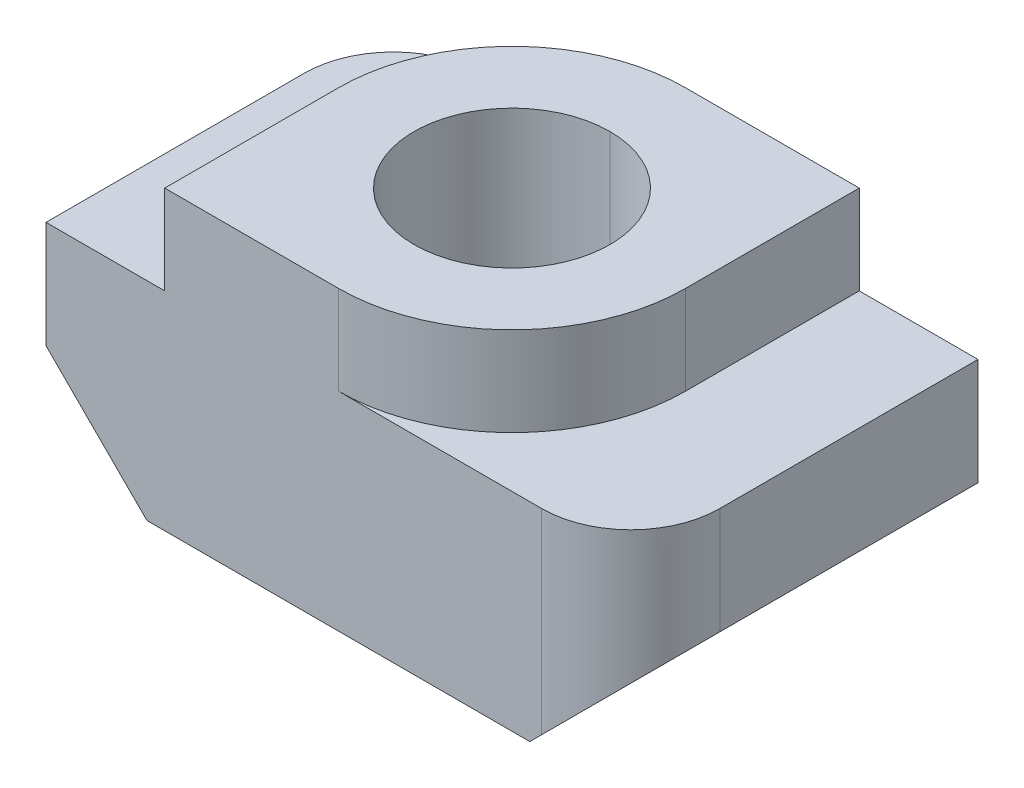
ISO-10303-21;
HEADER;
FILE_DESCRIPTION(('STEP AP214'),'2;1');
FILE_NAME('part.step','',(''),(''),'','','');
FILE_SCHEMA(('AUTOMOTIVE_DESIGN { 1 0 10303 214 1 1 1 1 }'));
ENDSEC;
DATA;
#1=APPLICATION_CONTEXT('core data for automotive mechanical design processes');
#2=APPLICATION_PROTOCOL_DEFINITION('international standard','automotive_design',2000,#1);
#3=PRODUCT_CONTEXT('',#1,'mechanical');
#4=PRODUCT('Part','Part','',(#3));
#5=PRODUCT_RELATED_PRODUCT_CATEGORY('part','',(#4));
#6=PRODUCT_DEFINITION_FORMATION('','',#4);
#7=PRODUCT_DEFINITION_CONTEXT('part definition',#1,'design');
#8=PRODUCT_DEFINITION('design','',#6,#7);
#9=PRODUCT_DEFINITION_SHAPE('','',#8);
#10=(LENGTH_UNIT() NAMED_UNIT(*) SI_UNIT(.MILLI.,.METRE.));
#11=(NAMED_UNIT(*) PLANE_ANGLE_UNIT() SI_UNIT($,.RADIAN.));
#12=(NAMED_UNIT(*) SI_UNIT($,.STERADIAN.) SOLID_ANGLE_UNIT());
#13=UNCERTAINTY_MEASURE_WITH_UNIT(LENGTH_MEASURE(1.E-05),#10,'distance_accuracy_value','');
#14=(GEOMETRIC_REPRESENTATION_CONTEXT(3) GLOBAL_UNCERTAINTY_ASSIGNED_CONTEXT((#13)) GLOBAL_UNIT_ASSIGNED_CONTEXT((#10,
#11,#12)) REPRESENTATION_CONTEXT('',''));
#15=CARTESIAN_POINT('',(0.,0.,0.));
#16=DIRECTION('',(0.,0.,1.));
#17=DIRECTION('',(1.,0.,0.));
#18=AXIS2_PLACEMENT_3D('',#15,#16,#17);
#19=CARTESIAN_POINT('',(3.425,3.5,1.425));
#20=DIRECTION('',(0.,-1.,0.));
#21=DIRECTION('',(0.,0.,-1.));
#22=AXIS2_PLACEMENT_3D('',#19,#20,#21);
#23=CYLINDRICAL_SURFACE('',#22,1.5);
#24=CARTESIAN_POINT('',(3.425,3.5,1.425));
#25=DIRECTION('',(0.,1.,0.));
#26=DIRECTION('',(0.,0.,-1.));
#27=AXIS2_PLACEMENT_3D('',#24,#25,#26);
#28=CIRCLE('',#27,1.5);
#29=CARTESIAN_POINT('',(3.425,3.5,2.925));
#30=VERTEX_POINT('',#29);
#31=CARTESIAN_POINT('',(4.925,3.5,1.425));
#32=VERTEX_POINT('',#31);
#33=EDGE_CURVE('E252',#30,#32,#28,.T.);
#34=ORIENTED_EDGE('',*,*,#33,.F.);
#35=DIRECTION('',(0.,1.,0.));
#36=VECTOR('',#35,1.);
#37=CARTESIAN_POINT('',(3.425,3.5,2.925));
#38=LINE('',#37,#36);
#39=CARTESIAN_POINT('',(3.425,0.200000000000006,2.925));
#40=VERTEX_POINT('',#39);
#41=EDGE_CURVE('E285',#40,#30,#38,.T.);
#42=ORIENTED_EDGE('',*,*,#41,.F.);
#43=CARTESIAN_POINT('',(4.925,1.7,1.425));
#44=CARTESIAN_POINT('',(4.925,1.7,2.30367965644035));
#45=CARTESIAN_POINT('',(4.30367965644036,1.07867965644036,2.925));
#46=CARTESIAN_POINT('',(3.425,0.200000000000006,2.925));
#47=(BOUNDED_CURVE() B_SPLINE_CURVE(3,(#43,#44,#45,#46),.UNSPECIFIED.,.F.,
.F.) B_SPLINE_CURVE_WITH_KNOTS((4,4),(3.1415926535898,4.71238898038469),
.UNSPECIFIED.) CURVE() GEOMETRIC_REPRESENTATION_ITEM() RATIONAL_B_SPLINE_CURVE((1.,
0.804737854124365,0.804737854124365,1.)) REPRESENTATION_ITEM(''));
#48=CARTESIAN_POINT('',(4.925,1.7,1.425));
#49=VERTEX_POINT('',#48);
#50=EDGE_CURVE('E11',#49,#40,#47,.T.);
#51=ORIENTED_EDGE('',*,*,#50,.F.);
#52=DIRECTION('',(0.,-1.,0.));
#53=VECTOR('',#52,1.);
#54=CARTESIAN_POINT('',(4.925,3.5,1.425));
#55=LINE('',#54,#53);
#56=EDGE_CURVE('E263',#32,#49,#55,.T.);
#57=ORIENTED_EDGE('',*,*,#56,.F.);
#58=EDGE_LOOP('',(#34,#42,#51,#57));
#59=FACE_BOUND('',#58,.T.);
#60=ADVANCED_FACE('F17',(#59),#23,.T.);
#61=CARTESIAN_POINT('',(-3.425,3.5,-1.425));
#62=DIRECTION('',(0.,-1.,0.));
#63=DIRECTION('',(0.,0.,-1.));
#64=AXIS2_PLACEMENT_3D('',#61,#62,#63);
#65=CYLINDRICAL_SURFACE('',#64,1.5);
#66=CARTESIAN_POINT('',(-3.425,3.5,-1.425));
#67=DIRECTION('',(0.,1.,0.));
#68=DIRECTION('',(0.,0.,-1.));
#69=AXIS2_PLACEMENT_3D('',#66,#67,#68);
#70=CIRCLE('',#69,1.5);
#71=CARTESIAN_POINT('',(-3.425,3.5,-2.925));
#72=VERTEX_POINT('',#71);
#73=CARTESIAN_POINT('',(-4.925,3.5,-1.425));
#74=VERTEX_POINT('',#73);
#75=EDGE_CURVE('E219',#72,#74,#70,.T.);
#76=ORIENTED_EDGE('',*,*,#75,.F.);
#77=DIRECTION('',(0.,1.,0.));
#78=VECTOR('',#77,1.);
#79=CARTESIAN_POINT('',(-3.425,3.5,-2.925));
#80=LINE('',#79,#78);
#81=CARTESIAN_POINT('',(-3.425,0.200000000000004,-2.925));
#82=VERTEX_POINT('',#81);
#83=EDGE_CURVE('E328',#82,#72,#80,.T.);
#84=ORIENTED_EDGE('',*,*,#83,.F.);
#85=CARTESIAN_POINT('',(-4.925,1.7,-1.425));
#86=CARTESIAN_POINT('',(-4.925,1.7,-2.30367965644035));
#87=CARTESIAN_POINT('',(-4.30367965644036,1.07867965644036,-2.925));
#88=CARTESIAN_POINT('',(-3.425,0.200000000000004,-2.925));
#89=(BOUNDED_CURVE() B_SPLINE_CURVE(3,(#85,#86,#87,#88),.UNSPECIFIED.,.F.,
.F.) B_SPLINE_CURVE_WITH_KNOTS((4,4),(3.1415926535898,4.71238898038469),
.UNSPECIFIED.) CURVE() GEOMETRIC_REPRESENTATION_ITEM() RATIONAL_B_SPLINE_CURVE((1.,
0.804737854124365,0.804737854124365,1.)) REPRESENTATION_ITEM(''));
#90=CARTESIAN_POINT('',(-4.925,1.7,-1.425));
#91=VERTEX_POINT('',#90);
#92=EDGE_CURVE('E20',#91,#82,#89,.T.);
#93=ORIENTED_EDGE('',*,*,#92,.F.);
#94=DIRECTION('',(0.,-1.,0.));
#95=VECTOR('',#94,1.);
#96=CARTESIAN_POINT('',(-4.925,3.5,-1.425));
#97=LINE('',#96,#95);
#98=EDGE_CURVE('E239',#74,#91,#97,.T.);
#99=ORIENTED_EDGE('',*,*,#98,.F.);
#100=EDGE_LOOP('',(#76,#84,#93,#99));
#101=FACE_BOUND('',#100,.T.);
#102=ADVANCED_FACE('F365',(#101),#65,.T.);
#103=CARTESIAN_POINT('',(4.925,1.7,-2.925));
#104=DIRECTION('',(0.707106781186546,-0.707106781186549,0.));
#105=DIRECTION('',(0.,0.,-1.));
#106=AXIS2_PLACEMENT_3D('',#103,#104,#105);
#107=PLANE('',#106);
#108=DIRECTION('',(0.,0.,-1.));
#109=VECTOR('',#108,1.);
#110=CARTESIAN_POINT('',(4.925,1.7,-2.925));
#111=LINE('',#110,#109);
#112=CARTESIAN_POINT('',(4.925,1.7,-2.925));
#113=VERTEX_POINT('',#112);
#114=EDGE_CURVE('E267',#49,#113,#111,.T.);
#115=ORIENTED_EDGE('',*,*,#114,.F.);
#116=ORIENTED_EDGE('',*,*,#50,.T.);
#117=DIRECTION('',(0.707106781186549,0.707106781186546,0.));
#118=VECTOR('',#117,1.);
#119=CARTESIAN_POINT('',(4.925,1.7,2.925));
#120=LINE('',#119,#118);
#121=CARTESIAN_POINT('',(3.225,0.,2.925));
#122=VERTEX_POINT('',#121);
#123=EDGE_CURVE('E280',#122,#40,#120,.T.);
#124=ORIENTED_EDGE('',*,*,#123,.F.);
#125=DIRECTION('',(0.,0.,1.));
#126=VECTOR('',#125,1.);
#127=CARTESIAN_POINT('',(3.225,0.,2.925));
#128=LINE('',#127,#126);
#129=CARTESIAN_POINT('',(3.225,0.,-2.925));
#130=VERTEX_POINT('',#129);
#131=EDGE_CURVE('E183',#130,#122,#128,.T.);
#132=ORIENTED_EDGE('',*,*,#131,.F.);
#133=DIRECTION('',(-0.707106781186549,-0.707106781186546,0.));
#134=VECTOR('',#133,1.);
#135=CARTESIAN_POINT('',(4.925,1.7,-2.925));
#136=LINE('',#135,#134);
#137=EDGE_CURVE('E310',#113,#130,#136,.T.);
#138=ORIENTED_EDGE('',*,*,#137,.F.);
#139=EDGE_LOOP('',(#115,#116,#124,#132,#138));
#140=FACE_BOUND('',#139,.T.);
#141=ADVANCED_FACE('F414',(#140),#107,.T.);
#142=CARTESIAN_POINT('',(-4.925,1.7,-2.925));
#143=DIRECTION('',(-0.707106781186546,-0.707106781186549,0.));
#144=DIRECTION('',(-0.707106781186549,0.707106781186546,0.));
#145=AXIS2_PLACEMENT_3D('',#142,#143,#144);
#146=PLANE('',#145);
#147=DIRECTION('',(0.,0.,1.));
#148=VECTOR('',#147,1.);
#149=CARTESIAN_POINT('',(-4.925,1.7,2.925));
#150=LINE('',#149,#148);
#151=CARTESIAN_POINT('',(-4.925,1.7,2.925));
#152=VERTEX_POINT('',#151);
#153=EDGE_CURVE('E262',#91,#152,#150,.T.);
#154=ORIENTED_EDGE('',*,*,#153,.F.);
#155=ORIENTED_EDGE('',*,*,#92,.T.);
#156=DIRECTION('',(-0.707106781186549,0.707106781186546,0.));
#157=VECTOR('',#156,1.);
#158=CARTESIAN_POINT('',(-4.925,1.7,-2.925));
#159=LINE('',#158,#157);
#160=CARTESIAN_POINT('',(-3.225,0.,-2.925));
#161=VERTEX_POINT('',#160);
#162=EDGE_CURVE('E324',#161,#82,#159,.T.);
#163=ORIENTED_EDGE('',*,*,#162,.F.);
#164=DIRECTION('',(0.,0.,-1.));
#165=VECTOR('',#164,1.);
#166=CARTESIAN_POINT('',(-3.225,0.,-2.925));
#167=LINE('',#166,#165);
#168=CARTESIAN_POINT('',(-3.225,0.,2.925));
#169=VERTEX_POINT('',#168);
#170=EDGE_CURVE('E289',#169,#161,#167,.T.);
#171=ORIENTED_EDGE('',*,*,#170,.F.);
#172=DIRECTION('',(0.707106781186549,-0.707106781186546,0.));
#173=VECTOR('',#172,1.);
#174=CARTESIAN_POINT('',(-4.925,1.7,2.925));
#175=LINE('',#174,#173);
#176=EDGE_CURVE('E304',#152,#169,#175,.T.);
#177=ORIENTED_EDGE('',*,*,#176,.F.);
#178=EDGE_LOOP('',(#154,#155,#163,#171,#177));
#179=FACE_BOUND('',#178,.T.);
#180=ADVANCED_FACE('F362',(#179),#146,.T.);
#181=CARTESIAN_POINT('',(0.,0.,0.));
#182=DIRECTION('',(0.,1.,0.));
#183=DIRECTION('',(0.,0.,1.));
#184=AXIS2_PLACEMENT_3D('',#181,#182,#183);
#185=CYLINDRICAL_SURFACE('',#184,1.65);
#186=DIRECTION('',(0.,1.,0.));
#187=VECTOR('',#186,1.);
#188=CARTESIAN_POINT('',(0.,0.,-1.65));
#189=LINE('',#188,#187);
#190=CARTESIAN_POINT('',(0.,0.,-1.65));
#191=VERTEX_POINT('',#190);
#192=CARTESIAN_POINT('',(0.,5.,-1.65));
#193=VERTEX_POINT('',#192);
#194=EDGE_CURVE('E186',#191,#193,#189,.T.);
#195=ORIENTED_EDGE('',*,*,#194,.F.);
#196=CARTESIAN_POINT('',(0.,0.,0.));
#197=DIRECTION('',(0.,1.,0.));
#198=DIRECTION('',(0.,0.,1.));
#199=AXIS2_PLACEMENT_3D('',#196,#197,#198);
#200=CIRCLE('',#199,1.65);
#201=CARTESIAN_POINT('',(0.,0.,1.65));
#202=VERTEX_POINT('',#201);
#203=EDGE_CURVE('E172',#202,#191,#200,.T.);
#204=ORIENTED_EDGE('',*,*,#203,.F.);
#205=DIRECTION('',(0.,1.,0.));
#206=VECTOR('',#205,1.);
#207=CARTESIAN_POINT('',(0.,0.,1.65));
#208=LINE('',#207,#206);
#209=CARTESIAN_POINT('',(0.,5.,1.65));
#210=VERTEX_POINT('',#209);
#211=EDGE_CURVE('E196',#202,#210,#208,.T.);
#212=ORIENTED_EDGE('',*,*,#211,.T.);
#213=CARTESIAN_POINT('',(0.,5.,0.));
#214=DIRECTION('',(0.,1.,0.));
#215=DIRECTION('',(0.,0.,1.));
#216=AXIS2_PLACEMENT_3D('',#213,#214,#215);
#217=CIRCLE('',#216,1.65);
#218=EDGE_CURVE('E188',#210,#193,#217,.T.);
#219=ORIENTED_EDGE('',*,*,#218,.T.);
#220=EDGE_LOOP('',(#195,#204,#212,#219));
#221=FACE_BOUND('',#220,.T.);
#222=ADVANCED_FACE('F187',(#221),#185,.F.);
#223=CARTESIAN_POINT('',(0.,5.,0.));
#224=DIRECTION('',(0.,1.,0.));
#225=DIRECTION('',(1.,0.,0.));
#226=AXIS2_PLACEMENT_3D('',#223,#224,#225);
#227=PLANE('',#226);
#228=ORIENTED_EDGE('',*,*,#218,.F.);
#229=CARTESIAN_POINT('',(0.,5.,0.));
#230=DIRECTION('',(0.,1.,0.));
#231=DIRECTION('',(0.,0.,1.));
#232=AXIS2_PLACEMENT_3D('',#229,#230,#231);
#233=CIRCLE('',#232,1.65);
#234=EDGE_CURVE('E193',#193,#210,#233,.T.);
#235=ORIENTED_EDGE('',*,*,#234,.F.);
#236=EDGE_LOOP('',(#228,#235));
#237=FACE_BOUND('',#236,.T.);
#238=CARTESIAN_POINT('',(0.,5.,0.));
#239=DIRECTION('',(0.,1.,0.));
#240=DIRECTION('',(0.,0.,1.));
#241=AXIS2_PLACEMENT_3D('',#238,#239,#240);
#242=CIRCLE('',#241,2.925);
#243=CARTESIAN_POINT('',(0.,5.,2.925));
#244=VERTEX_POINT('',#243);
#245=CARTESIAN_POINT('',(2.925,5.,0.));
#246=VERTEX_POINT('',#245);
#247=EDGE_CURVE('E227',#244,#246,#242,.T.);
#248=ORIENTED_EDGE('',*,*,#247,.T.);
#249=DIRECTION('',(0.,0.,-1.));
#250=VECTOR('',#249,1.);
#251=CARTESIAN_POINT('',(2.925,5.,0.));
#252=LINE('',#251,#250);
#253=CARTESIAN_POINT('',(2.925,5.,-2.925));
#254=VERTEX_POINT('',#253);
#255=EDGE_CURVE('E52',#246,#254,#252,.T.);
#256=ORIENTED_EDGE('',*,*,#255,.T.);
#257=DIRECTION('',(-1.,0.,0.));
#258=VECTOR('',#257,1.);
#259=CARTESIAN_POINT('',(2.925,5.,-2.925));
#260=LINE('',#259,#258);
#261=CARTESIAN_POINT('',(0.,5.,-2.925));
#262=VERTEX_POINT('',#261);
#263=EDGE_CURVE('E334',#254,#262,#260,.T.);
#264=ORIENTED_EDGE('',*,*,#263,.T.);
#265=CARTESIAN_POINT('',(0.,5.,0.));
#266=DIRECTION('',(0.,1.,0.));
#267=DIRECTION('',(0.,0.,1.));
#268=AXIS2_PLACEMENT_3D('',#265,#266,#267);
#269=CIRCLE('',#268,2.925);
#270=CARTESIAN_POINT('',(-2.925,5.,0.));
#271=VERTEX_POINT('',#270);
#272=EDGE_CURVE('E346',#262,#271,#269,.T.);
#273=ORIENTED_EDGE('',*,*,#272,.T.);
#274=DIRECTION('',(0.,0.,1.));
#275=VECTOR('',#274,1.);
#276=CARTESIAN_POINT('',(-2.925,5.,0.));
#277=LINE('',#276,#275);
#278=CARTESIAN_POINT('',(-2.925,5.,2.925));
#279=VERTEX_POINT('',#278);
#280=EDGE_CURVE('E41',#271,#279,#277,.T.);
#281=ORIENTED_EDGE('',*,*,#280,.T.);
#282=DIRECTION('',(1.,0.,0.));
#283=VECTOR('',#282,1.);
#284=CARTESIAN_POINT('',(-2.925,5.,2.925));
#285=LINE('',#284,#283);
#286=EDGE_CURVE('E295',#279,#244,#285,.T.);
#287=ORIENTED_EDGE('',*,*,#286,.T.);
#288=EDGE_LOOP('',(#248,#256,#264,#273,#281,#287));
#289=FACE_BOUND('',#288,.T.);
#290=ADVANCED_FACE('F386',(#237,#289),#227,.T.);
#291=CARTESIAN_POINT('',(-2.925,5.,0.));
#292=DIRECTION('',(1.,0.,0.));
#293=DIRECTION('',(0.,1.,0.));
#294=AXIS2_PLACEMENT_3D('',#291,#292,#293);
#295=PLANE('',#294);
#296=DIRECTION('',(0.,0.,1.));
#297=VECTOR('',#296,1.);
#298=CARTESIAN_POINT('',(-2.925,3.5,0.));
#299=LINE('',#298,#297);
#300=CARTESIAN_POINT('',(-2.925,3.5,0.));
#301=VERTEX_POINT('',#300);
#302=CARTESIAN_POINT('',(-2.925,3.5,2.925));
#303=VERTEX_POINT('',#302);
#304=EDGE_CURVE('E243',#301,#303,#299,.T.);
#305=ORIENTED_EDGE('',*,*,#304,.T.);
#306=DIRECTION('',(0.,-1.,0.));
#307=VECTOR('',#306,1.);
#308=CARTESIAN_POINT('',(-2.925,5.,2.925));
#309=LINE('',#308,#307);
#310=EDGE_CURVE('E301',#279,#303,#309,.T.);
#311=ORIENTED_EDGE('',*,*,#310,.F.);
#312=ORIENTED_EDGE('',*,*,#280,.F.);
#313=DIRECTION('',(0.,-1.,0.));
#314=VECTOR('',#313,1.);
#315=CARTESIAN_POINT('',(-2.925,5.,0.));
#316=LINE('',#315,#314);
#317=EDGE_CURVE('E226',#271,#301,#316,.T.);
#318=ORIENTED_EDGE('',*,*,#317,.T.);
#319=EDGE_LOOP('',(#305,#311,#312,#318));
#320=FACE_BOUND('',#319,.T.);
#321=ADVANCED_FACE('F470',(#320),#295,.F.);
#322=CARTESIAN_POINT('',(0.,5.,0.));
#323=DIRECTION('',(0.,-1.,0.));
#324=DIRECTION('',(0.,0.,-1.));
#325=AXIS2_PLACEMENT_3D('',#322,#323,#324);
#326=CYLINDRICAL_SURFACE('',#325,2.925);
#327=CARTESIAN_POINT('',(0.,3.5,0.));
#328=DIRECTION('',(0.,1.,0.));
#329=DIRECTION('',(0.,0.,1.));
#330=AXIS2_PLACEMENT_3D('',#327,#328,#329);
#331=CIRCLE('',#330,2.925);
#332=CARTESIAN_POINT('',(0.,3.5,-2.925));
#333=VERTEX_POINT('',#332);
#334=EDGE_CURVE('E247',#333,#301,#331,.T.);
#335=ORIENTED_EDGE('',*,*,#334,.T.);
#336=ORIENTED_EDGE('',*,*,#317,.F.);
#337=ORIENTED_EDGE('',*,*,#272,.F.);
#338=DIRECTION('',(0.,-1.,0.));
#339=VECTOR('',#338,1.);
#340=CARTESIAN_POINT('',(0.,5.,-2.925));
#341=LINE('',#340,#339);
#342=EDGE_CURVE('E331',#262,#333,#341,.T.);
#343=ORIENTED_EDGE('',*,*,#342,.T.);
#344=EDGE_LOOP('',(#335,#336,#337,#343));
#345=FACE_BOUND('',#344,.T.);
#346=ADVANCED_FACE('F384',(#345),#326,.T.);
#347=CARTESIAN_POINT('',(2.925,5.,0.));
#348=DIRECTION('',(-1.,0.,0.));
#349=DIRECTION('',(0.,0.,1.));
#350=AXIS2_PLACEMENT_3D('',#347,#348,#349);
#351=PLANE('',#350);
#352=DIRECTION('',(0.,0.,-1.));
#353=VECTOR('',#352,1.);
#354=CARTESIAN_POINT('',(2.925,3.5,0.));
#355=LINE('',#354,#353);
#356=CARTESIAN_POINT('',(2.925,3.5,0.));
#357=VERTEX_POINT('',#356);
#358=CARTESIAN_POINT('',(2.925,3.5,-2.925));
#359=VERTEX_POINT('',#358);
#360=EDGE_CURVE('E205',#357,#359,#355,.T.);
#361=ORIENTED_EDGE('',*,*,#360,.T.);
#362=DIRECTION('',(0.,-1.,0.));
#363=VECTOR('',#362,1.);
#364=CARTESIAN_POINT('',(2.925,5.,-2.925));
#365=LINE('',#364,#363);
#366=EDGE_CURVE('E340',#254,#359,#365,.T.);
#367=ORIENTED_EDGE('',*,*,#366,.F.);
#368=ORIENTED_EDGE('',*,*,#255,.F.);
#369=DIRECTION('',(0.,-1.,0.));
#370=VECTOR('',#369,1.);
#371=CARTESIAN_POINT('',(2.925,5.,0.));
#372=LINE('',#371,#370);
#373=EDGE_CURVE('E182',#246,#357,#372,.T.);
#374=ORIENTED_EDGE('',*,*,#373,.T.);
#375=EDGE_LOOP('',(#361,#367,#368,#374));
#376=FACE_BOUND('',#375,.T.);
#377=ADVANCED_FACE('F388',(#376),#351,.F.);
#378=CARTESIAN_POINT('',(0.,5.,0.));
#379=DIRECTION('',(0.,-1.,0.));
#380=DIRECTION('',(0.,0.,-1.));
#381=AXIS2_PLACEMENT_3D('',#378,#379,#380);
#382=CYLINDRICAL_SURFACE('',#381,2.925);
#383=CARTESIAN_POINT('',(0.,3.5,0.));
#384=DIRECTION('',(0.,1.,0.));
#385=DIRECTION('',(0.,0.,1.));
#386=AXIS2_PLACEMENT_3D('',#383,#384,#385);
#387=CIRCLE('',#386,2.925);
#388=CARTESIAN_POINT('',(0.,3.5,2.925));
#389=VERTEX_POINT('',#388);
#390=EDGE_CURVE('E209',#389,#357,#387,.T.);
#391=ORIENTED_EDGE('',*,*,#390,.T.);
#392=ORIENTED_EDGE('',*,*,#373,.F.);
#393=ORIENTED_EDGE('',*,*,#247,.F.);
#394=DIRECTION('',(0.,-1.,0.));
#395=VECTOR('',#394,1.);
#396=CARTESIAN_POINT('',(0.,5.,2.925));
#397=LINE('',#396,#395);
#398=EDGE_CURVE('E288',#244,#389,#397,.T.);
#399=ORIENTED_EDGE('',*,*,#398,.T.);
#400=EDGE_LOOP('',(#391,#392,#393,#399));
#401=FACE_BOUND('',#400,.T.);
#402=ADVANCED_FACE('F497',(#401),#382,.T.);
#403=CARTESIAN_POINT('',(0.,0.,0.));
#404=DIRECTION('',(0.,-1.,0.));
#405=DIRECTION('',(0.,0.,-1.));
#406=AXIS2_PLACEMENT_3D('',#403,#404,#405);
#407=PLANE('',#406);
#408=ORIENTED_EDGE('',*,*,#203,.T.);
#409=CARTESIAN_POINT('',(0.,0.,0.));
#410=DIRECTION('',(0.,1.,0.));
#411=DIRECTION('',(0.,0.,1.));
#412=AXIS2_PLACEMENT_3D('',#409,#410,#411);
#413=CIRCLE('',#412,1.65);
#414=EDGE_CURVE('E177',#191,#202,#413,.T.);
#415=ORIENTED_EDGE('',*,*,#414,.T.);
#416=EDGE_LOOP('',(#408,#415));
#417=FACE_BOUND('',#416,.T.);
#418=DIRECTION('',(1.,0.,0.));
#419=VECTOR('',#418,1.);
#420=CARTESIAN_POINT('',(4.925,0.,2.925));
#421=LINE('',#420,#419);
#422=EDGE_CURVE('E268',#169,#122,#421,.T.);
#423=ORIENTED_EDGE('',*,*,#422,.F.);
#424=ORIENTED_EDGE('',*,*,#170,.T.);
#425=DIRECTION('',(-1.,0.,0.));
#426=VECTOR('',#425,1.);
#427=CARTESIAN_POINT('',(4.925,0.,-2.925));
#428=LINE('',#427,#426);
#429=EDGE_CURVE('E292',#130,#161,#428,.T.);
#430=ORIENTED_EDGE('',*,*,#429,.F.);
#431=ORIENTED_EDGE('',*,*,#131,.T.);
#432=EDGE_LOOP('',(#423,#424,#430,#431));
#433=FACE_BOUND('',#432,.T.);
#434=ADVANCED_FACE('F174',(#417,#433),#407,.T.);
#435=CARTESIAN_POINT('',(4.925,3.5,-2.925));
#436=DIRECTION('',(0.,0.,1.));
#437=DIRECTION('',(1.,0.,0.));
#438=AXIS2_PLACEMENT_3D('',#435,#436,#437);
#439=PLANE('',#438);
#440=ORIENTED_EDGE('',*,*,#162,.T.);
#441=ORIENTED_EDGE('',*,*,#83,.T.);
#442=DIRECTION('',(-1.,0.,0.));
#443=VECTOR('',#442,1.);
#444=CARTESIAN_POINT('',(4.925,3.5,-2.925));
#445=LINE('',#444,#443);
#446=EDGE_CURVE('E215',#333,#72,#445,.T.);
#447=ORIENTED_EDGE('',*,*,#446,.F.);
#448=ORIENTED_EDGE('',*,*,#342,.F.);
#449=ORIENTED_EDGE('',*,*,#263,.F.);
#450=ORIENTED_EDGE('',*,*,#366,.T.);
#451=DIRECTION('',(-1.,0.,0.));
#452=VECTOR('',#451,1.);
#453=CARTESIAN_POINT('',(4.925,3.5,-2.925));
#454=LINE('',#453,#452);
#455=CARTESIAN_POINT('',(4.925,3.5,-2.925));
#456=VERTEX_POINT('',#455);
#457=EDGE_CURVE('E210',#456,#359,#454,.T.);
#458=ORIENTED_EDGE('',*,*,#457,.F.);
#459=DIRECTION('',(0.,-1.,0.));
#460=VECTOR('',#459,1.);
#461=CARTESIAN_POINT('',(4.925,3.5,-2.925));
#462=LINE('',#461,#460);
#463=EDGE_CURVE('E320',#456,#113,#462,.T.);
#464=ORIENTED_EDGE('',*,*,#463,.T.);
#465=ORIENTED_EDGE('',*,*,#137,.T.);
#466=ORIENTED_EDGE('',*,*,#429,.T.);
#467=EDGE_LOOP('',(#440,#441,#447,#448,#449,#450,#458,#464,#465,#466));
#468=FACE_BOUND('',#467,.T.);
#469=ADVANCED_FACE('F368',(#468),#439,.F.);
#470=CARTESIAN_POINT('',(4.925,3.5,-2.925));
#471=DIRECTION('',(-1.,0.,0.));
#472=DIRECTION('',(0.,1.,0.));
#473=AXIS2_PLACEMENT_3D('',#470,#471,#472);
#474=PLANE('',#473);
#475=DIRECTION('',(0.,0.,-1.));
#476=VECTOR('',#475,1.);
#477=CARTESIAN_POINT('',(4.925,3.5,-2.925));
#478=LINE('',#477,#476);
#479=EDGE_CURVE('E214',#32,#456,#478,.T.);
#480=ORIENTED_EDGE('',*,*,#479,.F.);
#481=ORIENTED_EDGE('',*,*,#56,.T.);
#482=ORIENTED_EDGE('',*,*,#114,.T.);
#483=ORIENTED_EDGE('',*,*,#463,.F.);
#484=EDGE_LOOP('',(#480,#481,#482,#483));
#485=FACE_BOUND('',#484,.T.);
#486=ADVANCED_FACE('F412',(#485),#474,.F.);
#487=CARTESIAN_POINT('',(4.925,3.5,2.925));
#488=DIRECTION('',(0.,0.,-1.));
#489=DIRECTION('',(-1.,0.,0.));
#490=AXIS2_PLACEMENT_3D('',#487,#488,#489);
#491=PLANE('',#490);
#492=ORIENTED_EDGE('',*,*,#123,.T.);
#493=ORIENTED_EDGE('',*,*,#41,.T.);
#494=DIRECTION('',(1.,0.,0.));
#495=VECTOR('',#494,1.);
#496=CARTESIAN_POINT('',(4.925,3.5,2.925));
#497=LINE('',#496,#495);
#498=EDGE_CURVE('E251',#389,#30,#497,.T.);
#499=ORIENTED_EDGE('',*,*,#498,.F.);
#500=ORIENTED_EDGE('',*,*,#398,.F.);
#501=ORIENTED_EDGE('',*,*,#286,.F.);
#502=ORIENTED_EDGE('',*,*,#310,.T.);
#503=DIRECTION('',(1.,0.,0.));
#504=VECTOR('',#503,1.);
#505=CARTESIAN_POINT('',(4.925,3.5,2.925));
#506=LINE('',#505,#504);
#507=CARTESIAN_POINT('',(-4.925,3.5,2.925));
#508=VERTEX_POINT('',#507);
#509=EDGE_CURVE('E235',#508,#303,#506,.T.);
#510=ORIENTED_EDGE('',*,*,#509,.F.);
#511=DIRECTION('',(0.,-1.,0.));
#512=VECTOR('',#511,1.);
#513=CARTESIAN_POINT('',(-4.925,3.5,2.925));
#514=LINE('',#513,#512);
#515=EDGE_CURVE('E271',#508,#152,#514,.T.);
#516=ORIENTED_EDGE('',*,*,#515,.T.);
#517=ORIENTED_EDGE('',*,*,#176,.T.);
#518=ORIENTED_EDGE('',*,*,#422,.T.);
#519=EDGE_LOOP('',(#492,#493,#499,#500,#501,#502,#510,#516,#517,#518));
#520=FACE_BOUND('',#519,.T.);
#521=ADVANCED_FACE('F373',(#520),#491,.F.);
#522=CARTESIAN_POINT('',(-4.925,3.5,-2.925));
#523=DIRECTION('',(1.,0.,0.));
#524=DIRECTION('',(0.,0.,-1.));
#525=AXIS2_PLACEMENT_3D('',#522,#523,#524);
#526=PLANE('',#525);
#527=DIRECTION('',(0.,0.,1.));
#528=VECTOR('',#527,1.);
#529=CARTESIAN_POINT('',(-4.925,3.5,-2.925));
#530=LINE('',#529,#528);
#531=EDGE_CURVE('E231',#74,#508,#530,.T.);
#532=ORIENTED_EDGE('',*,*,#531,.F.);
#533=ORIENTED_EDGE('',*,*,#98,.T.);
#534=ORIENTED_EDGE('',*,*,#153,.T.);
#535=ORIENTED_EDGE('',*,*,#515,.F.);
#536=EDGE_LOOP('',(#532,#533,#534,#535));
#537=FACE_BOUND('',#536,.T.);
#538=ADVANCED_FACE('F376',(#537),#526,.F.);
#539=CARTESIAN_POINT('',(0.,3.5,0.));
#540=DIRECTION('',(0.,-1.,0.));
#541=DIRECTION('',(0.,0.,-1.));
#542=AXIS2_PLACEMENT_3D('',#539,#540,#541);
#543=PLANE('',#542);
#544=ORIENTED_EDGE('',*,*,#498,.T.);
#545=ORIENTED_EDGE('',*,*,#33,.T.);
#546=ORIENTED_EDGE('',*,*,#479,.T.);
#547=ORIENTED_EDGE('',*,*,#457,.T.);
#548=ORIENTED_EDGE('',*,*,#360,.F.);
#549=ORIENTED_EDGE('',*,*,#390,.F.);
#550=EDGE_LOOP('',(#544,#545,#546,#547,#548,#549));
#551=FACE_BOUND('',#550,.T.);
#552=ADVANCED_FACE('F402',(#551),#543,.F.);
#553=CARTESIAN_POINT('',(0.,3.5,0.));
#554=DIRECTION('',(0.,-1.,0.));
#555=DIRECTION('',(0.,0.,-1.));
#556=AXIS2_PLACEMENT_3D('',#553,#554,#555);
#557=PLANE('',#556);
#558=ORIENTED_EDGE('',*,*,#446,.T.);
#559=ORIENTED_EDGE('',*,*,#75,.T.);
#560=ORIENTED_EDGE('',*,*,#531,.T.);
#561=ORIENTED_EDGE('',*,*,#509,.T.);
#562=ORIENTED_EDGE('',*,*,#304,.F.);
#563=ORIENTED_EDGE('',*,*,#334,.F.);
#564=EDGE_LOOP('',(#558,#559,#560,#561,#562,#563));
#565=FACE_BOUND('',#564,.T.);
#566=ADVANCED_FACE('F378',(#565),#557,.F.);
#567=CARTESIAN_POINT('',(0.,0.,0.));
#568=DIRECTION('',(0.,1.,0.));
#569=DIRECTION('',(0.,0.,1.));
#570=AXIS2_PLACEMENT_3D('',#567,#568,#569);
#571=CYLINDRICAL_SURFACE('',#570,1.65);
#572=ORIENTED_EDGE('',*,*,#414,.F.);
#573=ORIENTED_EDGE('',*,*,#194,.T.);
#574=ORIENTED_EDGE('',*,*,#234,.T.);
#575=ORIENTED_EDGE('',*,*,#211,.F.);
#576=EDGE_LOOP('',(#572,#573,#574,#575));
#577=FACE_BOUND('',#576,.T.);
#578=ADVANCED_FACE('F195',(#577),#571,.F.);
#579=CLOSED_SHELL('',(#60,#102,#141,#180,#222,#290,#321,#346,#377,#402,#434,#469,#486,#521,#538,
#552,#566,#578));
#580=MANIFOLD_SOLID_BREP('B1',#579);
#581=ADVANCED_BREP_SHAPE_REPRESENTATION('',(#18,#580),#14);
#582=SHAPE_DEFINITION_REPRESENTATION(#9,#581);
ENDSEC;
END-ISO-10303-21;
